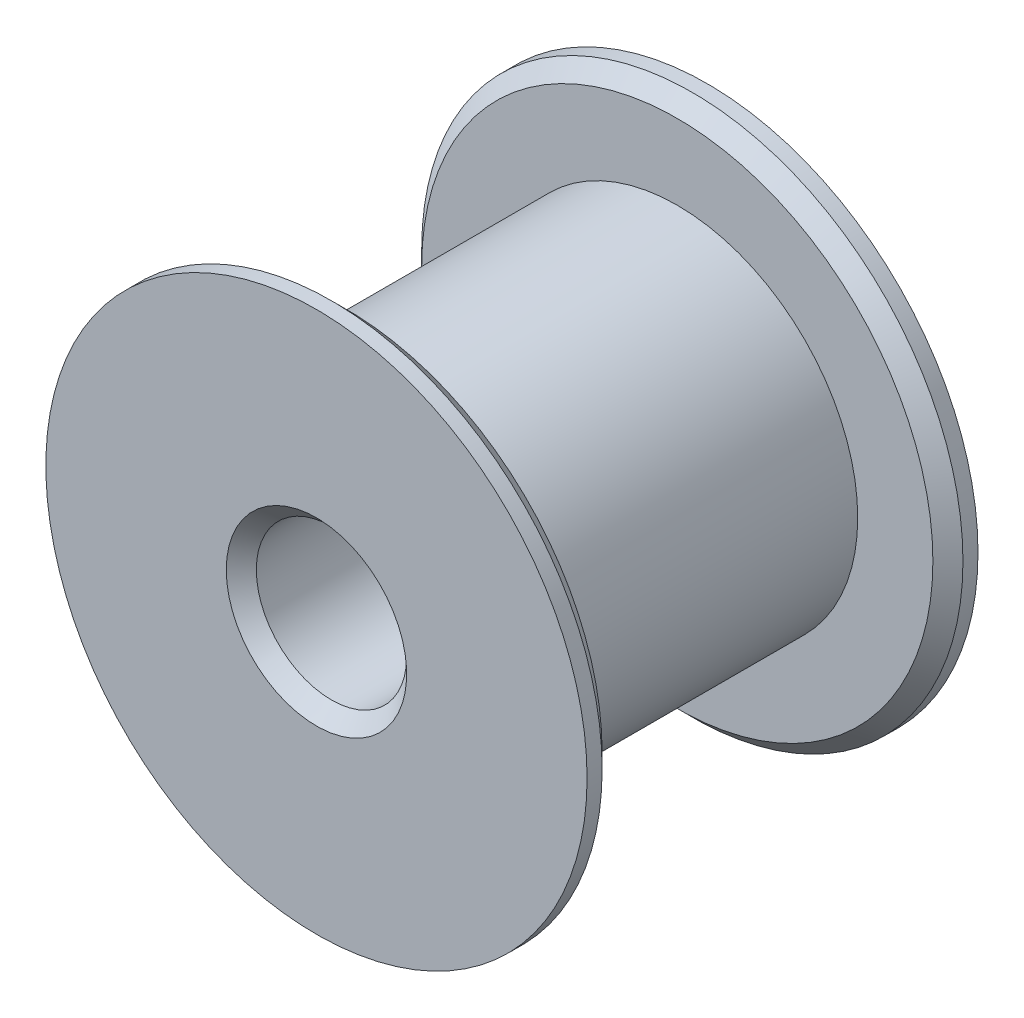
ISO-10303-21;
HEADER;
FILE_DESCRIPTION(('STEP AP214'),'2;1');
FILE_NAME('part.step','',(''),(''),'','','');
FILE_SCHEMA(('AUTOMOTIVE_DESIGN { 1 0 10303 214 1 1 1 1 }'));
ENDSEC;
DATA;
#1=APPLICATION_CONTEXT('core data for automotive mechanical design processes');
#2=APPLICATION_PROTOCOL_DEFINITION('international standard','automotive_design',2000,#1);
#3=PRODUCT_CONTEXT('',#1,'mechanical');
#4=PRODUCT('Part','Part','',(#3));
#5=PRODUCT_RELATED_PRODUCT_CATEGORY('part','',(#4));
#6=PRODUCT_DEFINITION_FORMATION('','',#4);
#7=PRODUCT_DEFINITION_CONTEXT('part definition',#1,'design');
#8=PRODUCT_DEFINITION('design','',#6,#7);
#9=PRODUCT_DEFINITION_SHAPE('','',#8);
#10=(LENGTH_UNIT() NAMED_UNIT(*) SI_UNIT(.MILLI.,.METRE.));
#11=(NAMED_UNIT(*) PLANE_ANGLE_UNIT() SI_UNIT($,.RADIAN.));
#12=(NAMED_UNIT(*) SI_UNIT($,.STERADIAN.) SOLID_ANGLE_UNIT());
#13=UNCERTAINTY_MEASURE_WITH_UNIT(LENGTH_MEASURE(1.E-05),#10,'distance_accuracy_value','');
#14=(GEOMETRIC_REPRESENTATION_CONTEXT(3) GLOBAL_UNCERTAINTY_ASSIGNED_CONTEXT((#13)) GLOBAL_UNIT_ASSIGNED_CONTEXT((#10,
#11,#12)) REPRESENTATION_CONTEXT('',''));
#15=CARTESIAN_POINT('',(0.,0.,0.));
#16=DIRECTION('',(0.,0.,1.));
#17=DIRECTION('',(1.,0.,0.));
#18=AXIS2_PLACEMENT_3D('',#15,#16,#17);
#19=CARTESIAN_POINT('',(-2.5,0.,-13.));
#20=DIRECTION('',(0.,0.,1.));
#21=DIRECTION('',(1.,0.,0.));
#22=AXIS2_PLACEMENT_3D('',#19,#20,#21);
#23=PLANE('',#22);
#24=CARTESIAN_POINT('',(0.,0.,-13.));
#25=DIRECTION('',(0.,0.,1.));
#26=DIRECTION('',(1.,0.,0.));
#27=AXIS2_PLACEMENT_3D('',#24,#25,#26);
#28=CIRCLE('',#27,3.);
#29=CARTESIAN_POINT('',(3.,0.,-13.));
#30=VERTEX_POINT('',#29);
#31=EDGE_CURVE('E63',#30,#30,#28,.T.);
#32=ORIENTED_EDGE('',*,*,#31,.T.);
#33=EDGE_LOOP('',(#32));
#34=FACE_BOUND('',#33,.T.);
#35=CARTESIAN_POINT('',(0.,0.,-13.));
#36=DIRECTION('',(0.,0.,1.));
#37=DIRECTION('',(1.,0.,0.));
#38=AXIS2_PLACEMENT_3D('',#35,#36,#37);
#39=CIRCLE('',#38,9.);
#40=CARTESIAN_POINT('',(9.,0.,-13.));
#41=VERTEX_POINT('',#40);
#42=EDGE_CURVE('E66',#41,#41,#39,.T.);
#43=ORIENTED_EDGE('',*,*,#42,.F.);
#44=EDGE_LOOP('',(#43));
#45=FACE_BOUND('',#44,.T.);
#46=ADVANCED_FACE('F33',(#34,#45),#23,.F.);
#47=CARTESIAN_POINT('',(0.,0.,0.));
#48=DIRECTION('',(0.,0.,1.));
#49=DIRECTION('',(1.,0.,0.));
#50=AXIS2_PLACEMENT_3D('',#47,#48,#49);
#51=CYLINDRICAL_SURFACE('',#50,9.);
#52=CARTESIAN_POINT('',(0.,0.,-12.5));
#53=DIRECTION('',(0.,0.,-1.));
#54=DIRECTION('',(-1.,0.,0.));
#55=AXIS2_PLACEMENT_3D('',#52,#53,#54);
#56=CIRCLE('',#55,9.);
#57=CARTESIAN_POINT('',(-9.,0.,-12.5));
#58=VERTEX_POINT('',#57);
#59=EDGE_CURVE('E45',#58,#58,#56,.T.);
#60=ORIENTED_EDGE('',*,*,#59,.T.);
#61=EDGE_LOOP('',(#60));
#62=FACE_BOUND('',#61,.T.);
#63=ORIENTED_EDGE('',*,*,#42,.T.);
#64=EDGE_LOOP('',(#63));
#65=FACE_BOUND('',#64,.T.);
#66=ADVANCED_FACE('F95',(#62,#65),#51,.T.);
#67=CARTESIAN_POINT('',(-6.,0.,-12.));
#68=DIRECTION('',(0.,0.,-1.));
#69=DIRECTION('',(-1.,0.,0.));
#70=AXIS2_PLACEMENT_3D('',#67,#68,#69);
#71=PLANE('',#70);
#72=CARTESIAN_POINT('',(0.,0.,-12.));
#73=DIRECTION('',(0.,0.,-1.));
#74=DIRECTION('',(-1.,0.,0.));
#75=AXIS2_PLACEMENT_3D('',#72,#73,#74);
#76=CIRCLE('',#75,8.5);
#77=CARTESIAN_POINT('',(-8.5,0.,-12.));
#78=VERTEX_POINT('',#77);
#79=EDGE_CURVE('E49',#78,#78,#76,.F.);
#80=ORIENTED_EDGE('',*,*,#79,.T.);
#81=EDGE_LOOP('',(#80));
#82=FACE_BOUND('',#81,.T.);
#83=CARTESIAN_POINT('',(0.,0.,-12.));
#84=DIRECTION('',(0.,0.,1.));
#85=DIRECTION('',(1.,0.,0.));
#86=AXIS2_PLACEMENT_3D('',#83,#84,#85);
#87=CIRCLE('',#86,6.);
#88=CARTESIAN_POINT('',(6.,0.,-12.));
#89=VERTEX_POINT('',#88);
#90=EDGE_CURVE('E69',#89,#89,#87,.T.);
#91=ORIENTED_EDGE('',*,*,#90,.F.);
#92=EDGE_LOOP('',(#91));
#93=FACE_BOUND('',#92,.T.);
#94=ADVANCED_FACE('F101',(#82,#93),#71,.F.);
#95=CARTESIAN_POINT('',(0.,0.,0.));
#96=DIRECTION('',(0.,0.,1.));
#97=DIRECTION('',(1.,0.,0.));
#98=AXIS2_PLACEMENT_3D('',#95,#96,#97);
#99=CYLINDRICAL_SURFACE('',#98,6.);
#100=CARTESIAN_POINT('',(0.,0.,-1.));
#101=DIRECTION('',(0.,0.,1.));
#102=DIRECTION('',(1.,0.,0.));
#103=AXIS2_PLACEMENT_3D('',#100,#101,#102);
#104=CIRCLE('',#103,6.);
#105=CARTESIAN_POINT('',(6.,0.,-1.));
#106=VERTEX_POINT('',#105);
#107=EDGE_CURVE('E72',#106,#106,#104,.T.);
#108=ORIENTED_EDGE('',*,*,#107,.F.);
#109=EDGE_LOOP('',(#108));
#110=FACE_BOUND('',#109,.T.);
#111=ORIENTED_EDGE('',*,*,#90,.T.);
#112=EDGE_LOOP('',(#111));
#113=FACE_BOUND('',#112,.T.);
#114=ADVANCED_FACE('F92',(#110,#113),#99,.T.);
#115=CARTESIAN_POINT('',(-9.,0.,-1.));
#116=DIRECTION('',(0.,0.,1.));
#117=DIRECTION('',(1.,0.,0.));
#118=AXIS2_PLACEMENT_3D('',#115,#116,#117);
#119=PLANE('',#118);
#120=CARTESIAN_POINT('',(0.,0.,-1.));
#121=DIRECTION('',(0.,0.,1.));
#122=DIRECTION('',(1.,0.,0.));
#123=AXIS2_PLACEMENT_3D('',#120,#121,#122);
#124=CIRCLE('',#123,8.5);
#125=CARTESIAN_POINT('',(8.5,0.,-1.));
#126=VERTEX_POINT('',#125);
#127=EDGE_CURVE('E10',#126,#126,#124,.F.);
#128=ORIENTED_EDGE('',*,*,#127,.T.);
#129=EDGE_LOOP('',(#128));
#130=FACE_BOUND('',#129,.T.);
#131=ORIENTED_EDGE('',*,*,#107,.T.);
#132=EDGE_LOOP('',(#131));
#133=FACE_BOUND('',#132,.T.);
#134=ADVANCED_FACE('F83',(#130,#133),#119,.F.);
#135=CARTESIAN_POINT('',(0.,0.,0.));
#136=DIRECTION('',(0.,0.,1.));
#137=DIRECTION('',(1.,0.,0.));
#138=AXIS2_PLACEMENT_3D('',#135,#136,#137);
#139=CYLINDRICAL_SURFACE('',#138,9.);
#140=CARTESIAN_POINT('',(0.,0.,-0.500000000000001));
#141=DIRECTION('',(0.,0.,1.));
#142=DIRECTION('',(1.,0.,0.));
#143=AXIS2_PLACEMENT_3D('',#140,#141,#142);
#144=CIRCLE('',#143,9.);
#145=CARTESIAN_POINT('',(9.,0.,-0.500000000000002));
#146=VERTEX_POINT('',#145);
#147=EDGE_CURVE('E41',#146,#146,#144,.T.);
#148=ORIENTED_EDGE('',*,*,#147,.T.);
#149=EDGE_LOOP('',(#148));
#150=FACE_BOUND('',#149,.T.);
#151=CARTESIAN_POINT('',(0.,0.,0.));
#152=DIRECTION('',(0.,0.,1.));
#153=DIRECTION('',(1.,0.,0.));
#154=AXIS2_PLACEMENT_3D('',#151,#152,#153);
#155=CIRCLE('',#154,9.);
#156=CARTESIAN_POINT('',(9.,0.,0.));
#157=VERTEX_POINT('',#156);
#158=EDGE_CURVE('E75',#157,#157,#155,.T.);
#159=ORIENTED_EDGE('',*,*,#158,.F.);
#160=EDGE_LOOP('',(#159));
#161=FACE_BOUND('',#160,.T.);
#162=ADVANCED_FACE('F81',(#150,#161),#139,.T.);
#163=CARTESIAN_POINT('',(-9.,0.,0.));
#164=DIRECTION('',(0.,0.,-1.));
#165=DIRECTION('',(-1.,0.,0.));
#166=AXIS2_PLACEMENT_3D('',#163,#164,#165);
#167=PLANE('',#166);
#168=CARTESIAN_POINT('',(0.,0.,0.));
#169=DIRECTION('',(0.,0.,-1.));
#170=DIRECTION('',(-1.,0.,0.));
#171=AXIS2_PLACEMENT_3D('',#168,#169,#170);
#172=CIRCLE('',#171,3.);
#173=CARTESIAN_POINT('',(-3.,0.,0.));
#174=VERTEX_POINT('',#173);
#175=EDGE_CURVE('E54',#174,#174,#172,.T.);
#176=ORIENTED_EDGE('',*,*,#175,.T.);
#177=EDGE_LOOP('',(#176));
#178=FACE_BOUND('',#177,.T.);
#179=ORIENTED_EDGE('',*,*,#158,.T.);
#180=EDGE_LOOP('',(#179));
#181=FACE_BOUND('',#180,.T.);
#182=ADVANCED_FACE('F79',(#178,#181),#167,.F.);
#183=CARTESIAN_POINT('',(0.,0.,0.));
#184=DIRECTION('',(0.,0.,1.));
#185=DIRECTION('',(1.,0.,0.));
#186=AXIS2_PLACEMENT_3D('',#183,#184,#185);
#187=CYLINDRICAL_SURFACE('',#186,2.5);
#188=CARTESIAN_POINT('',(0.,0.,-12.5));
#189=DIRECTION('',(0.,0.,1.));
#190=DIRECTION('',(1.,0.,0.));
#191=AXIS2_PLACEMENT_3D('',#188,#189,#190);
#192=CIRCLE('',#191,2.5);
#193=CARTESIAN_POINT('',(2.5,0.,-12.5));
#194=VERTEX_POINT('',#193);
#195=EDGE_CURVE('E57',#194,#194,#192,.F.);
#196=ORIENTED_EDGE('',*,*,#195,.T.);
#197=EDGE_LOOP('',(#196));
#198=FACE_BOUND('',#197,.T.);
#199=CARTESIAN_POINT('',(0.,0.,-0.500000000000001));
#200=DIRECTION('',(0.,0.,-1.));
#201=DIRECTION('',(-1.,0.,0.));
#202=AXIS2_PLACEMENT_3D('',#199,#200,#201);
#203=CIRCLE('',#202,2.5);
#204=CARTESIAN_POINT('',(-2.5,0.,-0.5));
#205=VERTEX_POINT('',#204);
#206=EDGE_CURVE('E60',#205,#205,#203,.F.);
#207=ORIENTED_EDGE('',*,*,#206,.T.);
#208=EDGE_LOOP('',(#207));
#209=FACE_BOUND('',#208,.T.);
#210=ADVANCED_FACE('F89',(#198,#209),#187,.F.);
#211=CARTESIAN_POINT('',(0.,0.,-13.));
#212=DIRECTION('',(0.,0.,-1.));
#213=DIRECTION('',(-1.,0.,0.));
#214=AXIS2_PLACEMENT_3D('',#211,#212,#213);
#215=CONICAL_SURFACE('',#214,3.,0.785398163397446);
#216=ORIENTED_EDGE('',*,*,#195,.F.);
#217=EDGE_LOOP('',(#216));
#218=FACE_BOUND('',#217,.T.);
#219=ORIENTED_EDGE('',*,*,#31,.F.);
#220=EDGE_LOOP('',(#219));
#221=FACE_BOUND('',#220,.T.);
#222=ADVANCED_FACE('F108',(#218,#221),#215,.F.);
#223=CARTESIAN_POINT('',(0.,0.,-0.500000000000001));
#224=DIRECTION('',(0.,0.,1.));
#225=DIRECTION('',(1.,0.,0.));
#226=AXIS2_PLACEMENT_3D('',#223,#224,#225);
#227=CONICAL_SURFACE('',#226,2.5,0.785398163397448);
#228=ORIENTED_EDGE('',*,*,#175,.F.);
#229=EDGE_LOOP('',(#228));
#230=FACE_BOUND('',#229,.T.);
#231=ORIENTED_EDGE('',*,*,#206,.F.);
#232=EDGE_LOOP('',(#231));
#233=FACE_BOUND('',#232,.T.);
#234=ADVANCED_FACE('F114',(#230,#233),#227,.F.);
#235=CARTESIAN_POINT('',(0.,0.,-12.));
#236=DIRECTION('',(0.,0.,-1.));
#237=DIRECTION('',(-1.,0.,0.));
#238=AXIS2_PLACEMENT_3D('',#235,#236,#237);
#239=CONICAL_SURFACE('',#238,8.5,0.785398163397448);
#240=ORIENTED_EDGE('',*,*,#59,.F.);
#241=EDGE_LOOP('',(#240));
#242=FACE_BOUND('',#241,.T.);
#243=ORIENTED_EDGE('',*,*,#79,.F.);
#244=EDGE_LOOP('',(#243));
#245=FACE_BOUND('',#244,.T.);
#246=ADVANCED_FACE('F120',(#242,#245),#239,.T.);
#247=CARTESIAN_POINT('',(0.,0.,-0.500000000000001));
#248=DIRECTION('',(0.,0.,1.));
#249=DIRECTION('',(1.,0.,0.));
#250=AXIS2_PLACEMENT_3D('',#247,#248,#249);
#251=CONICAL_SURFACE('',#250,9.,0.78539816339745);
#252=ORIENTED_EDGE('',*,*,#127,.F.);
#253=EDGE_LOOP('',(#252));
#254=FACE_BOUND('',#253,.T.);
#255=ORIENTED_EDGE('',*,*,#147,.F.);
#256=EDGE_LOOP('',(#255));
#257=FACE_BOUND('',#256,.T.);
#258=ADVANCED_FACE('F36',(#254,#257),#251,.T.);
#259=CLOSED_SHELL('',(#46,#66,#94,#114,#134,#162,#182,#210,#222,#234,#246,#258));
#260=MANIFOLD_SOLID_BREP('B2',#259);
#261=ADVANCED_BREP_SHAPE_REPRESENTATION('',(#18,#260),#14);
#262=SHAPE_DEFINITION_REPRESENTATION(#9,#261);
ENDSEC;
END-ISO-10303-21;
